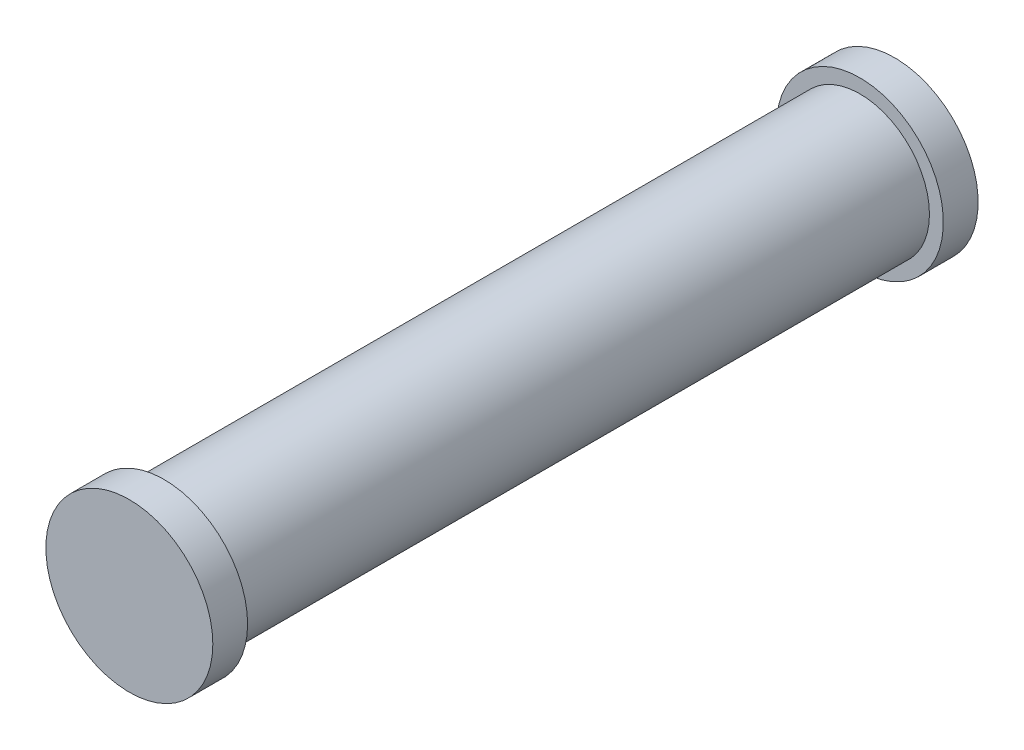
ISO-10303-21;
HEADER;
FILE_DESCRIPTION(('STEP AP214'),'2;1');
FILE_NAME('part.step','',(''),(''),'','','');
FILE_SCHEMA(('AUTOMOTIVE_DESIGN { 1 0 10303 214 1 1 1 1 }'));
ENDSEC;
DATA;
#1=APPLICATION_CONTEXT('core data for automotive mechanical design processes');
#2=APPLICATION_PROTOCOL_DEFINITION('international standard','automotive_design',2000,#1);
#3=PRODUCT_CONTEXT('',#1,'mechanical');
#4=PRODUCT('Part','Part','',(#3));
#5=PRODUCT_RELATED_PRODUCT_CATEGORY('part','',(#4));
#6=PRODUCT_DEFINITION_FORMATION('','',#4);
#7=PRODUCT_DEFINITION_CONTEXT('part definition',#1,'design');
#8=PRODUCT_DEFINITION('design','',#6,#7);
#9=PRODUCT_DEFINITION_SHAPE('','',#8);
#10=(LENGTH_UNIT() NAMED_UNIT(*) SI_UNIT(.MILLI.,.METRE.));
#11=(NAMED_UNIT(*) PLANE_ANGLE_UNIT() SI_UNIT($,.RADIAN.));
#12=(NAMED_UNIT(*) SI_UNIT($,.STERADIAN.) SOLID_ANGLE_UNIT());
#13=UNCERTAINTY_MEASURE_WITH_UNIT(LENGTH_MEASURE(1.E-05),#10,'distance_accuracy_value','');
#14=(GEOMETRIC_REPRESENTATION_CONTEXT(3) GLOBAL_UNCERTAINTY_ASSIGNED_CONTEXT((#13)) GLOBAL_UNIT_ASSIGNED_CONTEXT((#10,
#11,#12)) REPRESENTATION_CONTEXT('',''));
#15=CARTESIAN_POINT('',(0.,0.,0.));
#16=DIRECTION('',(0.,0.,1.));
#17=DIRECTION('',(1.,0.,0.));
#18=AXIS2_PLACEMENT_3D('',#15,#16,#17);
#19=CARTESIAN_POINT('',(0.,0.,5.));
#20=DIRECTION('',(0.,0.,-1.));
#21=DIRECTION('',(-1.,0.,0.));
#22=AXIS2_PLACEMENT_3D('',#19,#20,#21);
#23=CYLINDRICAL_SURFACE('',#22,0.5);
#24=CARTESIAN_POINT('',(0.,0.,5.));
#25=DIRECTION('',(0.,0.,1.));
#26=DIRECTION('',(1.,0.,0.));
#27=AXIS2_PLACEMENT_3D('',#24,#25,#26);
#28=CIRCLE('',#27,0.5);
#29=CARTESIAN_POINT('',(0.5,0.,5.));
#30=VERTEX_POINT('',#29);
#31=EDGE_CURVE('E10',#30,#30,#28,.T.);
#32=ORIENTED_EDGE('',*,*,#31,.F.);
#33=EDGE_LOOP('',(#32));
#34=FACE_BOUND('',#33,.T.);
#35=CARTESIAN_POINT('',(0.,0.,0.));
#36=DIRECTION('',(0.,0.,1.));
#37=DIRECTION('',(1.,0.,0.));
#38=AXIS2_PLACEMENT_3D('',#35,#36,#37);
#39=CIRCLE('',#38,0.5);
#40=CARTESIAN_POINT('',(0.5,0.,0.));
#41=VERTEX_POINT('',#40);
#42=EDGE_CURVE('E38',#41,#41,#39,.T.);
#43=ORIENTED_EDGE('',*,*,#42,.T.);
#44=EDGE_LOOP('',(#43));
#45=FACE_BOUND('',#44,.T.);
#46=ADVANCED_FACE('F35',(#34,#45),#23,.T.);
#47=CARTESIAN_POINT('',(0.,0.,5.25));
#48=DIRECTION('',(0.,0.,-1.));
#49=DIRECTION('',(-1.,0.,0.));
#50=AXIS2_PLACEMENT_3D('',#47,#48,#49);
#51=CYLINDRICAL_SURFACE('',#50,0.6);
#52=CARTESIAN_POINT('',(0.,0.,5.25));
#53=DIRECTION('',(0.,0.,1.));
#54=DIRECTION('',(1.,0.,0.));
#55=AXIS2_PLACEMENT_3D('',#52,#53,#54);
#56=CIRCLE('',#55,0.6);
#57=CARTESIAN_POINT('',(0.6,0.,5.25));
#58=VERTEX_POINT('',#57);
#59=EDGE_CURVE('E42',#58,#58,#56,.T.);
#60=ORIENTED_EDGE('',*,*,#59,.F.);
#61=EDGE_LOOP('',(#60));
#62=FACE_BOUND('',#61,.T.);
#63=CARTESIAN_POINT('',(0.,0.,5.));
#64=DIRECTION('',(0.,0.,1.));
#65=DIRECTION('',(1.,0.,0.));
#66=AXIS2_PLACEMENT_3D('',#63,#64,#65);
#67=CIRCLE('',#66,0.6);
#68=CARTESIAN_POINT('',(0.6,0.,5.));
#69=VERTEX_POINT('',#68);
#70=EDGE_CURVE('E46',#69,#69,#67,.T.);
#71=ORIENTED_EDGE('',*,*,#70,.T.);
#72=EDGE_LOOP('',(#71));
#73=FACE_BOUND('',#72,.T.);
#74=ADVANCED_FACE('F83',(#62,#73),#51,.T.);
#75=CARTESIAN_POINT('',(0.,0.,5.25));
#76=DIRECTION('',(0.,0.,1.));
#77=DIRECTION('',(1.,0.,0.));
#78=AXIS2_PLACEMENT_3D('',#75,#76,#77);
#79=PLANE('',#78);
#80=ORIENTED_EDGE('',*,*,#59,.T.);
#81=EDGE_LOOP('',(#80));
#82=FACE_BOUND('',#81,.T.);
#83=ADVANCED_FACE('F79',(#82),#79,.T.);
#84=CARTESIAN_POINT('',(0.,0.,5.));
#85=DIRECTION('',(0.,0.,1.));
#86=DIRECTION('',(1.,0.,0.));
#87=AXIS2_PLACEMENT_3D('',#84,#85,#86);
#88=PLANE('',#87);
#89=ORIENTED_EDGE('',*,*,#31,.T.);
#90=EDGE_LOOP('',(#89));
#91=FACE_BOUND('',#90,.T.);
#92=ORIENTED_EDGE('',*,*,#70,.F.);
#93=EDGE_LOOP('',(#92));
#94=FACE_BOUND('',#93,.T.);
#95=ADVANCED_FACE('F71',(#91,#94),#88,.F.);
#96=CARTESIAN_POINT('',(0.,0.,-0.25));
#97=DIRECTION('',(0.,0.,1.));
#98=DIRECTION('',(1.,0.,0.));
#99=AXIS2_PLACEMENT_3D('',#96,#97,#98);
#100=CYLINDRICAL_SURFACE('',#99,0.6);
#101=CARTESIAN_POINT('',(0.,0.,-0.25));
#102=DIRECTION('',(0.,0.,-1.));
#103=DIRECTION('',(-1.,0.,0.));
#104=AXIS2_PLACEMENT_3D('',#101,#102,#103);
#105=CIRCLE('',#104,0.6);
#106=CARTESIAN_POINT('',(-0.6,0.,-0.25));
#107=VERTEX_POINT('',#106);
#108=EDGE_CURVE('E54',#107,#107,#105,.T.);
#109=ORIENTED_EDGE('',*,*,#108,.F.);
#110=EDGE_LOOP('',(#109));
#111=FACE_BOUND('',#110,.T.);
#112=CARTESIAN_POINT('',(0.,0.,0.));
#113=DIRECTION('',(0.,0.,-1.));
#114=DIRECTION('',(-1.,0.,0.));
#115=AXIS2_PLACEMENT_3D('',#112,#113,#114);
#116=CIRCLE('',#115,0.6);
#117=CARTESIAN_POINT('',(-0.6,0.,0.));
#118=VERTEX_POINT('',#117);
#119=EDGE_CURVE('E51',#118,#118,#116,.T.);
#120=ORIENTED_EDGE('',*,*,#119,.T.);
#121=EDGE_LOOP('',(#120));
#122=FACE_BOUND('',#121,.T.);
#123=ADVANCED_FACE('F69',(#111,#122),#100,.T.);
#124=CARTESIAN_POINT('',(0.,0.,-0.25));
#125=DIRECTION('',(0.,0.,-1.));
#126=DIRECTION('',(-1.,0.,0.));
#127=AXIS2_PLACEMENT_3D('',#124,#125,#126);
#128=PLANE('',#127);
#129=ORIENTED_EDGE('',*,*,#108,.T.);
#130=EDGE_LOOP('',(#129));
#131=FACE_BOUND('',#130,.T.);
#132=ADVANCED_FACE('F65',(#131),#128,.T.);
#133=CARTESIAN_POINT('',(0.,0.,0.));
#134=DIRECTION('',(0.,0.,-1.));
#135=DIRECTION('',(-1.,0.,0.));
#136=AXIS2_PLACEMENT_3D('',#133,#134,#135);
#137=PLANE('',#136);
#138=ORIENTED_EDGE('',*,*,#42,.F.);
#139=EDGE_LOOP('',(#138));
#140=FACE_BOUND('',#139,.T.);
#141=ORIENTED_EDGE('',*,*,#119,.F.);
#142=EDGE_LOOP('',(#141));
#143=FACE_BOUND('',#142,.T.);
#144=ADVANCED_FACE('F62',(#140,#143),#137,.F.);
#145=CLOSED_SHELL('',(#46,#74,#83,#95,#123,#132,#144));
#146=MANIFOLD_SOLID_BREP('B2',#145);
#147=ADVANCED_BREP_SHAPE_REPRESENTATION('',(#18,#146),#14);
#148=SHAPE_DEFINITION_REPRESENTATION(#9,#147);
ENDSEC;
END-ISO-10303-21;
